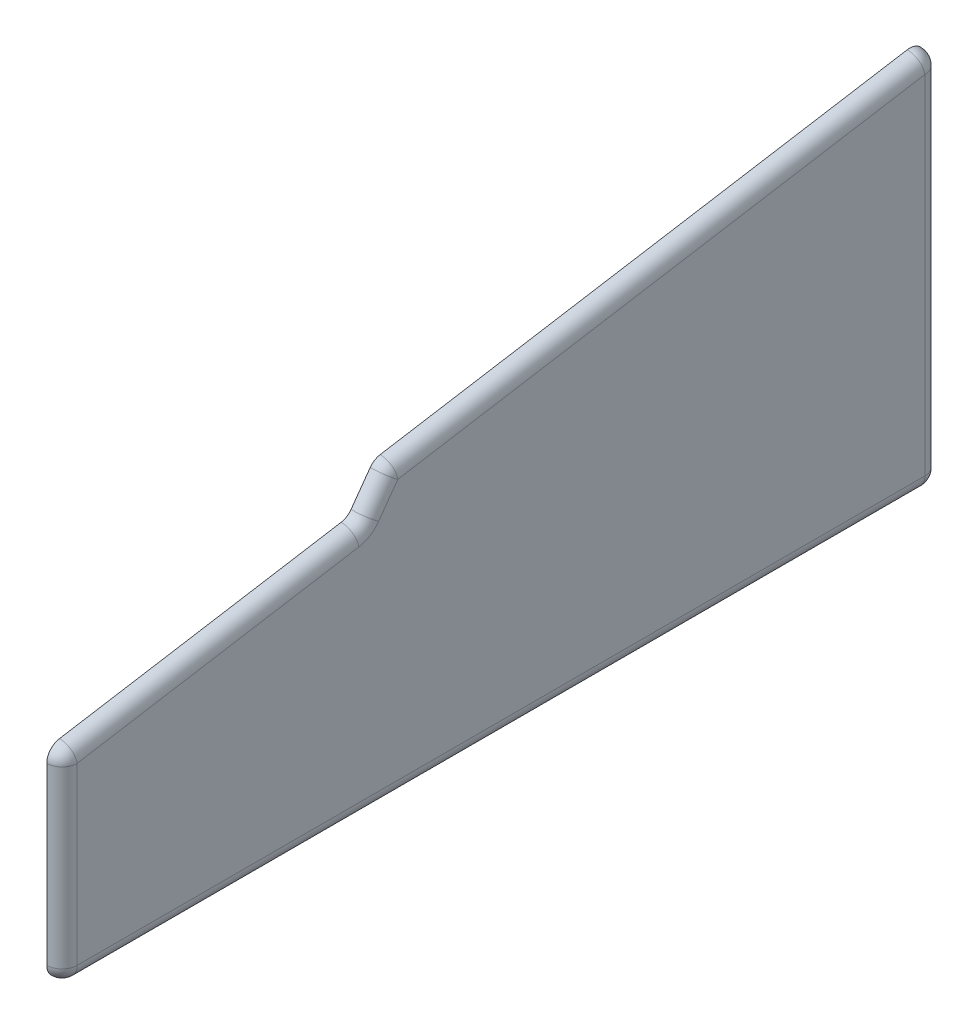
ISO-10303-21;
HEADER;
FILE_DESCRIPTION(('STEP AP214'),'2;1');
FILE_NAME('part.step','',(''),(''),'','','');
FILE_SCHEMA(('AUTOMOTIVE_DESIGN { 1 0 10303 214 1 1 1 1 }'));
ENDSEC;
DATA;
#1=APPLICATION_CONTEXT('core data for automotive mechanical design processes');
#2=APPLICATION_PROTOCOL_DEFINITION('international standard','automotive_design',2000,#1);
#3=PRODUCT_CONTEXT('',#1,'mechanical');
#4=PRODUCT('Part','Part','',(#3));
#5=PRODUCT_RELATED_PRODUCT_CATEGORY('part','',(#4));
#6=PRODUCT_DEFINITION_FORMATION('','',#4);
#7=PRODUCT_DEFINITION_CONTEXT('part definition',#1,'design');
#8=PRODUCT_DEFINITION('design','',#6,#7);
#9=PRODUCT_DEFINITION_SHAPE('','',#8);
#10=(LENGTH_UNIT() NAMED_UNIT(*) SI_UNIT(.MILLI.,.METRE.));
#11=(NAMED_UNIT(*) PLANE_ANGLE_UNIT() SI_UNIT($,.RADIAN.));
#12=(NAMED_UNIT(*) SI_UNIT($,.STERADIAN.) SOLID_ANGLE_UNIT());
#13=UNCERTAINTY_MEASURE_WITH_UNIT(LENGTH_MEASURE(1.E-05),#10,'distance_accuracy_value','');
#14=(GEOMETRIC_REPRESENTATION_CONTEXT(3) GLOBAL_UNCERTAINTY_ASSIGNED_CONTEXT((#13)) GLOBAL_UNIT_ASSIGNED_CONTEXT((#10,
#11,#12)) REPRESENTATION_CONTEXT('',''));
#15=CARTESIAN_POINT('',(0.,0.,0.));
#16=DIRECTION('',(0.,0.,1.));
#17=DIRECTION('',(1.,0.,0.));
#18=AXIS2_PLACEMENT_3D('',#15,#16,#17);
#19=CARTESIAN_POINT('',(-327.974562358316,0.,137.10500183886));
#20=DIRECTION('',(0.,0.,-1.));
#21=DIRECTION('',(1.,0.,0.));
#22=AXIS2_PLACEMENT_3D('',#19,#20,#21);
#23=PLANE('',#22);
#24=DIRECTION('',(0.,-1.,0.));
#25=VECTOR('',#24,1.);
#26=CARTESIAN_POINT('',(-325.974562358316,0.,137.10500183886));
#27=LINE('',#26,#25);
#28=CARTESIAN_POINT('',(-325.974562358316,14.690261728625,137.10500183886));
#29=VERTEX_POINT('',#28);
#30=CARTESIAN_POINT('',(-325.974562358316,-0.0195091277780118,137.10500183886));
#31=VERTEX_POINT('',#30);
#32=EDGE_CURVE('E239',#29,#31,#27,.T.);
#33=ORIENTED_EDGE('',*,*,#32,.F.);
#34=DIRECTION('',(1.,0.,0.));
#35=VECTOR('',#34,1.);
#36=CARTESIAN_POINT('',(-327.974562358316,14.690261728625,137.10500183886));
#37=LINE('',#36,#35);
#38=CARTESIAN_POINT('',(-327.974562358316,14.690261728625,137.10500183886));
#39=VERTEX_POINT('',#38);
#40=EDGE_CURVE('E271',#39,#29,#37,.T.);
#41=ORIENTED_EDGE('',*,*,#40,.F.);
#42=DIRECTION('',(0.,-1.,0.));
#43=VECTOR('',#42,1.);
#44=CARTESIAN_POINT('',(-327.974562358316,0.,137.10500183886));
#45=LINE('',#44,#43);
#46=CARTESIAN_POINT('',(-327.974562358316,-0.0195091277780118,137.10500183886));
#47=VERTEX_POINT('',#46);
#48=EDGE_CURVE('E240',#39,#47,#45,.T.);
#49=ORIENTED_EDGE('',*,*,#48,.T.);
#50=DIRECTION('',(1.,0.,0.));
#51=VECTOR('',#50,1.);
#52=CARTESIAN_POINT('',(-327.974562358316,-0.0195091277780118,137.10500183886));
#53=LINE('',#52,#51);
#54=EDGE_CURVE('E300',#47,#31,#53,.T.);
#55=ORIENTED_EDGE('',*,*,#54,.T.);
#56=EDGE_LOOP('',(#33,#41,#49,#55));
#57=FACE_BOUND('',#56,.T.);
#58=ADVANCED_FACE('F35',(#57),#23,.F.);
#59=CARTESIAN_POINT('',(-327.974562358316,-0.0195091277779954,0.));
#60=DIRECTION('',(0.,-1.,0.));
#61=DIRECTION('',(0.,0.,-1.));
#62=AXIS2_PLACEMENT_3D('',#59,#60,#61);
#63=PLANE('',#62);
#64=DIRECTION('',(0.,0.,1.));
#65=VECTOR('',#64,1.);
#66=CARTESIAN_POINT('',(-325.974562358316,-0.0195091277779954,0.));
#67=LINE('',#66,#65);
#68=CARTESIAN_POINT('',(-325.974562358316,-0.0195091277780113,129.50500183886));
#69=VERTEX_POINT('',#68);
#70=EDGE_CURVE('E244',#69,#31,#67,.T.);
#71=ORIENTED_EDGE('',*,*,#70,.T.);
#72=ORIENTED_EDGE('',*,*,#54,.F.);
#73=DIRECTION('',(0.,0.,1.));
#74=VECTOR('',#73,1.);
#75=CARTESIAN_POINT('',(-327.974562358316,-0.0195091277779954,0.));
#76=LINE('',#75,#74);
#77=CARTESIAN_POINT('',(-327.974562358316,-0.0195091277780113,129.50500183886));
#78=VERTEX_POINT('',#77);
#79=EDGE_CURVE('E269',#78,#47,#76,.T.);
#80=ORIENTED_EDGE('',*,*,#79,.F.);
#81=DIRECTION('',(1.,0.,0.));
#82=VECTOR('',#81,1.);
#83=CARTESIAN_POINT('',(-327.974562358316,-0.0195091277780113,129.50500183886));
#84=LINE('',#83,#82);
#85=EDGE_CURVE('E303',#78,#69,#84,.T.);
#86=ORIENTED_EDGE('',*,*,#85,.T.);
#87=EDGE_LOOP('',(#71,#72,#80,#86));
#88=FACE_BOUND('',#87,.T.);
#89=ADVANCED_FACE('F399',(#88),#63,.T.);
#90=CARTESIAN_POINT('',(-327.974562358316,0.,129.50500183886));
#91=DIRECTION('',(0.,0.,1.));
#92=DIRECTION('',(-1.,0.,0.));
#93=AXIS2_PLACEMENT_3D('',#90,#91,#92);
#94=PLANE('',#93);
#95=DIRECTION('',(0.,1.,0.));
#96=VECTOR('',#95,1.);
#97=CARTESIAN_POINT('',(-325.974562358316,0.,129.50500183886));
#98=LINE('',#97,#96);
#99=CARTESIAN_POINT('',(-325.974562358316,-17.019509127778,129.50500183886));
#100=VERTEX_POINT('',#99);
#101=EDGE_CURVE('E297',#100,#69,#98,.T.);
#102=ORIENTED_EDGE('',*,*,#101,.T.);
#103=ORIENTED_EDGE('',*,*,#85,.F.);
#104=DIRECTION('',(0.,1.,0.));
#105=VECTOR('',#104,1.);
#106=CARTESIAN_POINT('',(-327.974562358316,0.,129.50500183886));
#107=LINE('',#106,#105);
#108=CARTESIAN_POINT('',(-327.974562358316,-17.019509127778,129.50500183886));
#109=VERTEX_POINT('',#108);
#110=EDGE_CURVE('E267',#109,#78,#107,.T.);
#111=ORIENTED_EDGE('',*,*,#110,.F.);
#112=DIRECTION('',(1.,0.,0.));
#113=VECTOR('',#112,1.);
#114=CARTESIAN_POINT('',(-327.974562358316,-17.019509127778,129.50500183886));
#115=LINE('',#114,#113);
#116=EDGE_CURVE('E306',#109,#100,#115,.T.);
#117=ORIENTED_EDGE('',*,*,#116,.T.);
#118=EDGE_LOOP('',(#102,#103,#111,#117));
#119=FACE_BOUND('',#118,.T.);
#120=ADVANCED_FACE('F405',(#119),#94,.T.);
#121=CARTESIAN_POINT('',(-327.974562358316,-17.019509127778,0.));
#122=DIRECTION('',(0.,-1.,0.));
#123=DIRECTION('',(0.,0.,-1.));
#124=AXIS2_PLACEMENT_3D('',#121,#122,#123);
#125=PLANE('',#124);
#126=DIRECTION('',(0.,0.,1.));
#127=VECTOR('',#126,1.);
#128=CARTESIAN_POINT('',(-325.974562358316,-17.019509127778,0.));
#129=LINE('',#128,#127);
#130=CARTESIAN_POINT('',(-325.974562358316,-17.019509127778,-21.8489705992885));
#131=VERTEX_POINT('',#130);
#132=EDGE_CURVE('E295',#131,#100,#129,.T.);
#133=ORIENTED_EDGE('',*,*,#132,.T.);
#134=ORIENTED_EDGE('',*,*,#116,.F.);
#135=DIRECTION('',(0.,0.,1.));
#136=VECTOR('',#135,1.);
#137=CARTESIAN_POINT('',(-327.974562358316,-17.019509127778,0.));
#138=LINE('',#137,#136);
#139=CARTESIAN_POINT('',(-327.974562358316,-17.019509127778,-21.8489705992885));
#140=VERTEX_POINT('',#139);
#141=EDGE_CURVE('E265',#140,#109,#138,.T.);
#142=ORIENTED_EDGE('',*,*,#141,.F.);
#143=DIRECTION('',(1.,0.,0.));
#144=VECTOR('',#143,1.);
#145=CARTESIAN_POINT('',(-327.974562358316,-17.019509127778,-21.8489705992885));
#146=LINE('',#145,#144);
#147=EDGE_CURVE('E309',#140,#131,#146,.T.);
#148=ORIENTED_EDGE('',*,*,#147,.T.);
#149=EDGE_LOOP('',(#133,#134,#142,#148));
#150=FACE_BOUND('',#149,.T.);
#151=ADVANCED_FACE('F602',(#150),#125,.T.);
#152=CARTESIAN_POINT('',(-327.974562358316,0.,-21.8489705992885));
#153=DIRECTION('',(0.,0.,-1.));
#154=DIRECTION('',(0.,1.,0.));
#155=AXIS2_PLACEMENT_3D('',#152,#153,#154);
#156=PLANE('',#155);
#157=DIRECTION('',(0.,-1.,0.));
#158=VECTOR('',#157,1.);
#159=CARTESIAN_POINT('',(-325.974562358316,0.,-21.8489705992885));
#160=LINE('',#159,#158);
#161=CARTESIAN_POINT('',(-325.974562358316,-0.0195091277780118,-21.8489705992885));
#162=VERTEX_POINT('',#161);
#163=EDGE_CURVE('E293',#162,#131,#160,.T.);
#164=ORIENTED_EDGE('',*,*,#163,.T.);
#165=ORIENTED_EDGE('',*,*,#147,.F.);
#166=DIRECTION('',(0.,-1.,0.));
#167=VECTOR('',#166,1.);
#168=CARTESIAN_POINT('',(-327.974562358316,0.,-21.8489705992885));
#169=LINE('',#168,#167);
#170=CARTESIAN_POINT('',(-327.974562358316,-0.0195091277780118,-21.8489705992885));
#171=VERTEX_POINT('',#170);
#172=EDGE_CURVE('E263',#171,#140,#169,.T.);
#173=ORIENTED_EDGE('',*,*,#172,.F.);
#174=DIRECTION('',(1.,0.,0.));
#175=VECTOR('',#174,1.);
#176=CARTESIAN_POINT('',(-327.974562358316,-0.0195091277780118,-21.8489705992885));
#177=LINE('',#176,#175);
#178=EDGE_CURVE('E312',#171,#162,#177,.T.);
#179=ORIENTED_EDGE('',*,*,#178,.T.);
#180=EDGE_LOOP('',(#164,#165,#173,#179));
#181=FACE_BOUND('',#180,.T.);
#182=ADVANCED_FACE('F591',(#181),#156,.T.);
#183=CARTESIAN_POINT('',(-327.974562358316,-0.0195091277780118,0.));
#184=DIRECTION('',(0.,1.,0.));
#185=DIRECTION('',(0.,0.,1.));
#186=AXIS2_PLACEMENT_3D('',#183,#184,#185);
#187=PLANE('',#186);
#188=DIRECTION('',(0.,0.,-1.));
#189=VECTOR('',#188,1.);
#190=CARTESIAN_POINT('',(-325.974562358316,-0.0195091277780118,0.));
#191=LINE('',#190,#189);
#192=CARTESIAN_POINT('',(-325.974562358316,-0.0195091277780118,-29.4489705992885));
#193=VERTEX_POINT('',#192);
#194=EDGE_CURVE('E290',#162,#193,#191,.T.);
#195=ORIENTED_EDGE('',*,*,#194,.F.);
#196=ORIENTED_EDGE('',*,*,#178,.F.);
#197=DIRECTION('',(0.,0.,-1.));
#198=VECTOR('',#197,1.);
#199=CARTESIAN_POINT('',(-327.974562358316,-0.0195091277780118,0.));
#200=LINE('',#199,#198);
#201=CARTESIAN_POINT('',(-327.974562358316,-0.0195091277780118,-29.4489705992885));
#202=VERTEX_POINT('',#201);
#203=EDGE_CURVE('E260',#171,#202,#200,.T.);
#204=ORIENTED_EDGE('',*,*,#203,.T.);
#205=DIRECTION('',(1.,0.,0.));
#206=VECTOR('',#205,1.);
#207=CARTESIAN_POINT('',(-327.974562358316,-0.0195091277780118,-29.4489705992885));
#208=LINE('',#207,#206);
#209=EDGE_CURVE('E315',#202,#193,#208,.T.);
#210=ORIENTED_EDGE('',*,*,#209,.T.);
#211=EDGE_LOOP('',(#195,#196,#204,#210));
#212=FACE_BOUND('',#211,.T.);
#213=ADVANCED_FACE('F581',(#212),#187,.F.);
#214=CARTESIAN_POINT('',(-327.974562358316,0.,-29.4489705992885));
#215=DIRECTION('',(0.,0.,1.));
#216=DIRECTION('',(-1.,0.,0.));
#217=AXIS2_PLACEMENT_3D('',#214,#215,#216);
#218=PLANE('',#217);
#219=DIRECTION('',(0.,1.,0.));
#220=VECTOR('',#219,1.);
#221=CARTESIAN_POINT('',(-325.974562358316,0.,-29.4489705992885));
#222=LINE('',#221,#220);
#223=CARTESIAN_POINT('',(-325.974562358316,47.708117707001,-29.4489705992885));
#224=VERTEX_POINT('',#223);
#225=EDGE_CURVE('E287',#193,#224,#222,.T.);
#226=ORIENTED_EDGE('',*,*,#225,.F.);
#227=ORIENTED_EDGE('',*,*,#209,.F.);
#228=DIRECTION('',(0.,1.,0.));
#229=VECTOR('',#228,1.);
#230=CARTESIAN_POINT('',(-327.974562358316,0.,-29.4489705992885));
#231=LINE('',#230,#229);
#232=CARTESIAN_POINT('',(-327.974562358316,47.708117707001,-29.4489705992885));
#233=VERTEX_POINT('',#232);
#234=EDGE_CURVE('E257',#202,#233,#231,.T.);
#235=ORIENTED_EDGE('',*,*,#234,.T.);
#236=DIRECTION('',(1.,0.,0.));
#237=VECTOR('',#236,1.);
#238=CARTESIAN_POINT('',(-327.974562358316,47.708117707001,-29.4489705992885));
#239=LINE('',#238,#237);
#240=EDGE_CURVE('E318',#233,#224,#239,.T.);
#241=ORIENTED_EDGE('',*,*,#240,.T.);
#242=EDGE_LOOP('',(#226,#227,#235,#241));
#243=FACE_BOUND('',#242,.T.);
#244=ADVANCED_FACE('F571',(#243),#218,.F.);
#245=CARTESIAN_POINT('',(-327.974562358316,47.708117707001,-26.6489705992885));
#246=DIRECTION('',(1.,0.,0.));
#247=DIRECTION('',(0.,0.,1.));
#248=AXIS2_PLACEMENT_3D('',#245,#246,#247);
#249=CYLINDRICAL_SURFACE('',#248,2.8);
#250=CARTESIAN_POINT('',(-325.974562358316,47.708117707001,-26.6489705992885));
#251=DIRECTION('',(-1.,0.,0.));
#252=DIRECTION('',(0.,0.,1.));
#253=AXIS2_PLACEMENT_3D('',#250,#251,#252);
#254=CIRCLE('',#253,2.8);
#255=CARTESIAN_POINT('',(-325.974562358316,50.4706843968319,-26.1926535119064));
#256=VERTEX_POINT('',#255);
#257=EDGE_CURVE('E285',#256,#224,#254,.T.);
#258=ORIENTED_EDGE('',*,*,#257,.T.);
#259=ORIENTED_EDGE('',*,*,#240,.F.);
#260=CARTESIAN_POINT('',(-327.974562358316,47.708117707001,-26.6489705992885));
#261=DIRECTION('',(-1.,0.,0.));
#262=DIRECTION('',(0.,0.,1.));
#263=AXIS2_PLACEMENT_3D('',#260,#261,#262);
#264=CIRCLE('',#263,2.8);
#265=CARTESIAN_POINT('',(-327.974562358316,50.4706843968319,-26.1926535119064));
#266=VERTEX_POINT('',#265);
#267=EDGE_CURVE('E255',#266,#233,#264,.T.);
#268=ORIENTED_EDGE('',*,*,#267,.F.);
#269=DIRECTION('',(1.,0.,0.));
#270=VECTOR('',#269,1.);
#271=CARTESIAN_POINT('',(-327.974562358316,50.4706843968319,-26.1926535119064));
#272=LINE('',#271,#270);
#273=EDGE_CURVE('E321',#266,#256,#272,.T.);
#274=ORIENTED_EDGE('',*,*,#273,.T.);
#275=EDGE_LOOP('',(#258,#259,#268,#274));
#276=FACE_BOUND('',#275,.T.);
#277=ADVANCED_FACE('F561',(#276),#249,.T.);
#278=CARTESIAN_POINT('',(-327.974562358316,44.9186564788282,7.41960386657439));
#279=DIRECTION('',(0.,-0.98663096065388,-0.162970388350771));
#280=DIRECTION('',(0.,0.162970388350771,-0.98663096065388));
#281=AXIS2_PLACEMENT_3D('',#278,#279,#280);
#282=PLANE('',#281);
#283=DIRECTION('',(0.,-0.162970388350771,0.98663096065388));
#284=VECTOR('',#283,1.);
#285=CARTESIAN_POINT('',(-325.974562358316,44.9186564788282,7.41960386657439));
#286=LINE('',#285,#284);
#287=CARTESIAN_POINT('',(-325.974562358316,33.912543623929,74.0511668700437));
#288=VERTEX_POINT('',#287);
#289=EDGE_CURVE('E282',#256,#288,#286,.T.);
#290=ORIENTED_EDGE('',*,*,#289,.F.);
#291=ORIENTED_EDGE('',*,*,#273,.F.);
#292=DIRECTION('',(0.,-0.162970388350771,0.98663096065388));
#293=VECTOR('',#292,1.);
#294=CARTESIAN_POINT('',(-327.974562358316,44.9186564788282,7.41960386657439));
#295=LINE('',#294,#293);
#296=CARTESIAN_POINT('',(-327.974562358316,33.912543623929,74.0511668700437));
#297=VERTEX_POINT('',#296);
#298=EDGE_CURVE('E252',#266,#297,#295,.T.);
#299=ORIENTED_EDGE('',*,*,#298,.T.);
#300=DIRECTION('',(1.,0.,0.));
#301=VECTOR('',#300,1.);
#302=CARTESIAN_POINT('',(-327.974562358316,33.912543623929,74.0511668700437));
#303=LINE('',#302,#301);
#304=EDGE_CURVE('E324',#297,#288,#303,.T.);
#305=ORIENTED_EDGE('',*,*,#304,.T.);
#306=EDGE_LOOP('',(#290,#291,#299,#305));
#307=FACE_BOUND('',#306,.T.);
#308=ADVANCED_FACE('F551',(#307),#282,.F.);
#309=CARTESIAN_POINT('',(-327.974562358316,46.5622513804118,64.9879681018858));
#310=DIRECTION('',(0.,-0.582415976071519,-0.812890909542394));
#311=DIRECTION('',(0.,0.812890909542394,-0.582415976071519));
#312=AXIS2_PLACEMENT_3D('',#309,#310,#311);
#313=PLANE('',#312);
#314=DIRECTION('',(0.,-0.812890909542394,0.582415976071519));
#315=VECTOR('',#314,1.);
#316=CARTESIAN_POINT('',(-325.974562358316,46.5622513804118,64.9879681018858));
#317=LINE('',#316,#315);
#318=CARTESIAN_POINT('',(-325.974562358316,26.6175096435601,79.2778759970325));
#319=VERTEX_POINT('',#318);
#320=EDGE_CURVE('E279',#288,#319,#317,.T.);
#321=ORIENTED_EDGE('',*,*,#320,.F.);
#322=ORIENTED_EDGE('',*,*,#304,.F.);
#323=DIRECTION('',(0.,-0.812890909542394,0.582415976071519));
#324=VECTOR('',#323,1.);
#325=CARTESIAN_POINT('',(-327.974562358316,46.5622513804118,64.9879681018858));
#326=LINE('',#325,#324);
#327=CARTESIAN_POINT('',(-327.974562358316,26.6175096435601,79.2778759970325));
#328=VERTEX_POINT('',#327);
#329=EDGE_CURVE('E249',#297,#328,#326,.T.);
#330=ORIENTED_EDGE('',*,*,#329,.T.);
#331=DIRECTION('',(1.,0.,0.));
#332=VECTOR('',#331,1.);
#333=CARTESIAN_POINT('',(-327.974562358316,26.6175096435601,79.2778759970325));
#334=LINE('',#333,#332);
#335=EDGE_CURVE('E327',#328,#319,#334,.T.);
#336=ORIENTED_EDGE('',*,*,#335,.T.);
#337=EDGE_LOOP('',(#321,#322,#330,#336));
#338=FACE_BOUND('',#337,.T.);
#339=ADVANCED_FACE('F542',(#338),#313,.F.);
#340=CARTESIAN_POINT('',(-327.974562358316,38.6577849251494,6.38544143988436));
#341=DIRECTION('',(0.,-0.98663096065388,-0.162970388350771));
#342=DIRECTION('',(0.,0.162970388350771,-0.98663096065388));
#343=AXIS2_PLACEMENT_3D('',#340,#341,#342);
#344=PLANE('',#343);
#345=DIRECTION('',(0.,-0.162970388350772,0.98663096065388));
#346=VECTOR('',#345,1.);
#347=CARTESIAN_POINT('',(-325.974562358316,38.6577849251494,6.38544143988436));
#348=LINE('',#347,#346);
#349=CARTESIAN_POINT('',(-325.974562358316,17.4528284184559,134.761318926242));
#350=VERTEX_POINT('',#349);
#351=EDGE_CURVE('E276',#319,#350,#348,.T.);
#352=ORIENTED_EDGE('',*,*,#351,.F.);
#353=ORIENTED_EDGE('',*,*,#335,.F.);
#354=DIRECTION('',(0.,-0.162970388350772,0.98663096065388));
#355=VECTOR('',#354,1.);
#356=CARTESIAN_POINT('',(-327.974562358316,38.6577849251494,6.38544143988436));
#357=LINE('',#356,#355);
#358=CARTESIAN_POINT('',(-327.974562358316,17.4528284184559,134.761318926242));
#359=VERTEX_POINT('',#358);
#360=EDGE_CURVE('E246',#328,#359,#357,.T.);
#361=ORIENTED_EDGE('',*,*,#360,.T.);
#362=DIRECTION('',(1.,0.,0.));
#363=VECTOR('',#362,1.);
#364=CARTESIAN_POINT('',(-327.974562358316,17.4528284184559,134.761318926242));
#365=LINE('',#364,#363);
#366=EDGE_CURVE('E330',#359,#350,#365,.T.);
#367=ORIENTED_EDGE('',*,*,#366,.T.);
#368=EDGE_LOOP('',(#352,#353,#361,#367));
#369=FACE_BOUND('',#368,.T.);
#370=ADVANCED_FACE('F533',(#369),#344,.F.);
#371=CARTESIAN_POINT('',(-327.974562358316,14.690261728625,134.30500183886));
#372=DIRECTION('',(1.,0.,0.));
#373=DIRECTION('',(0.,0.,1.));
#374=AXIS2_PLACEMENT_3D('',#371,#372,#373);
#375=CYLINDRICAL_SURFACE('',#374,2.8);
#376=CARTESIAN_POINT('',(-325.974562358316,14.690261728625,134.30500183886));
#377=DIRECTION('',(-1.,0.,0.));
#378=DIRECTION('',(0.,0.,1.));
#379=AXIS2_PLACEMENT_3D('',#376,#377,#378);
#380=CIRCLE('',#379,2.8);
#381=EDGE_CURVE('E274',#29,#350,#380,.T.);
#382=ORIENTED_EDGE('',*,*,#381,.T.);
#383=ORIENTED_EDGE('',*,*,#366,.F.);
#384=CARTESIAN_POINT('',(-327.974562358316,14.690261728625,134.30500183886));
#385=DIRECTION('',(-1.,0.,0.));
#386=DIRECTION('',(0.,0.,1.));
#387=AXIS2_PLACEMENT_3D('',#384,#385,#386);
#388=CIRCLE('',#387,2.8);
#389=EDGE_CURVE('E243',#39,#359,#388,.T.);
#390=ORIENTED_EDGE('',*,*,#389,.F.);
#391=ORIENTED_EDGE('',*,*,#40,.T.);
#392=EDGE_LOOP('',(#382,#383,#390,#391));
#393=FACE_BOUND('',#392,.T.);
#394=ADVANCED_FACE('F411',(#393),#375,.T.);
#395=CARTESIAN_POINT('',(-327.974562358316,0.,0.));
#396=DIRECTION('',(1.,0.,0.));
#397=DIRECTION('',(0.,0.,1.));
#398=AXIS2_PLACEMENT_3D('',#395,#396,#397);
#399=PLANE('',#398);
#400=ORIENTED_EDGE('',*,*,#48,.F.);
#401=ORIENTED_EDGE('',*,*,#389,.T.);
#402=ORIENTED_EDGE('',*,*,#360,.F.);
#403=ORIENTED_EDGE('',*,*,#329,.F.);
#404=ORIENTED_EDGE('',*,*,#298,.F.);
#405=ORIENTED_EDGE('',*,*,#267,.T.);
#406=ORIENTED_EDGE('',*,*,#234,.F.);
#407=ORIENTED_EDGE('',*,*,#203,.F.);
#408=ORIENTED_EDGE('',*,*,#172,.T.);
#409=ORIENTED_EDGE('',*,*,#141,.T.);
#410=ORIENTED_EDGE('',*,*,#110,.T.);
#411=ORIENTED_EDGE('',*,*,#79,.T.);
#412=EDGE_LOOP('',(#400,#401,#402,#403,#404,#405,#406,#407,#408,#409,#410,#411));
#413=FACE_BOUND('',#412,.T.);
#414=ADVANCED_FACE('F514',(#413),#399,.F.);
#415=CARTESIAN_POINT('',(-322.974562358316,0.,0.));
#416=DIRECTION('',(1.,0.,0.));
#417=DIRECTION('',(0.,0.,1.));
#418=AXIS2_PLACEMENT_3D('',#415,#416,#417);
#419=PLANE('',#418);
#420=DIRECTION('',(0.,-1.,0.));
#421=VECTOR('',#420,1.);
#422=CARTESIAN_POINT('',(-322.974562358316,-17.219509127778,-29.6489705992885));
#423=LINE('',#422,#421);
#424=CARTESIAN_POINT('',(-322.974562358316,51.2443042896114,-29.6489705992885));
#425=VERTEX_POINT('',#424);
#426=CARTESIAN_POINT('',(-322.974562358316,-17.219509127778,-29.6489705992885));
#427=VERTEX_POINT('',#426);
#428=EDGE_CURVE('E44',#425,#427,#423,.T.);
#429=ORIENTED_EDGE('',*,*,#428,.F.);
#430=DIRECTION('',(0.,0.162970388350771,-0.98663096065388));
#431=VECTOR('',#430,1.);
#432=CARTESIAN_POINT('',(-322.974562358316,51.2443042896114,-29.6489705992885));
#433=LINE('',#432,#431);
#434=CARTESIAN_POINT('',(-322.974562358316,34.0963689070357,74.1654961327059));
#435=VERTEX_POINT('',#434);
#436=EDGE_CURVE('E345',#435,#425,#433,.T.);
#437=ORIENTED_EDGE('',*,*,#436,.F.);
#438=DIRECTION('',(0.,0.812890909542392,-0.582415976071521));
#439=VECTOR('',#438,1.);
#440=CARTESIAN_POINT('',(-322.974562358316,34.0963689070357,74.1654961327059));
#441=LINE('',#440,#439);
#442=CARTESIAN_POINT('',(-322.974562358316,28.8215975634404,77.9447376823052));
#443=VERTEX_POINT('',#442);
#444=EDGE_CURVE('E342',#443,#435,#441,.T.);
#445=ORIENTED_EDGE('',*,*,#444,.F.);
#446=CARTESIAN_POINT('',(-322.974562358316,32.3160934198696,82.8220831395595));
#447=DIRECTION('',(-1.,0.,0.));
#448=DIRECTION('',(0.,0.,1.));
#449=AXIS2_PLACEMENT_3D('',#446,#447,#448);
#450=CIRCLE('',#449,6.);
#451=CARTESIAN_POINT('',(-322.974562358316,26.3963076559463,81.8442608094549));
#452=VERTEX_POINT('',#451);
#453=EDGE_CURVE('E339',#452,#443,#450,.F.);
#454=ORIENTED_EDGE('',*,*,#453,.F.);
#455=DIRECTION('',(0.,0.162970388350772,-0.98663096065388));
#456=VECTOR('',#455,1.);
#457=CARTESIAN_POINT('',(-322.974562358316,26.3963076559463,81.8442608094549));
#458=LINE('',#457,#456);
#459=CARTESIAN_POINT('',(-322.974562358316,17.2353763004234,137.30500183886));
#460=VERTEX_POINT('',#459);
#461=EDGE_CURVE('E336',#460,#452,#458,.T.);
#462=ORIENTED_EDGE('',*,*,#461,.F.);
#463=DIRECTION('',(0.,1.,0.));
#464=VECTOR('',#463,1.);
#465=CARTESIAN_POINT('',(-322.974562358316,17.2353763004234,137.30500183886));
#466=LINE('',#465,#464);
#467=CARTESIAN_POINT('',(-322.974562358316,-17.219509127778,137.30500183886));
#468=VERTEX_POINT('',#467);
#469=EDGE_CURVE('E191',#468,#460,#466,.T.);
#470=ORIENTED_EDGE('',*,*,#469,.F.);
#471=DIRECTION('',(0.,0.,1.));
#472=VECTOR('',#471,1.);
#473=CARTESIAN_POINT('',(-322.974562358316,-17.219509127778,137.30500183886));
#474=LINE('',#473,#472);
#475=EDGE_CURVE('E11',#427,#468,#474,.T.);
#476=ORIENTED_EDGE('',*,*,#475,.F.);
#477=EDGE_LOOP('',(#429,#437,#445,#454,#462,#470,#476));
#478=FACE_BOUND('',#477,.T.);
#479=ADVANCED_FACE('F378',(#478),#419,.T.);
#480=CARTESIAN_POINT('',(-325.974562358316,0.,0.));
#481=DIRECTION('',(1.,0.,0.));
#482=DIRECTION('',(0.,0.,1.));
#483=AXIS2_PLACEMENT_3D('',#480,#481,#482);
#484=PLANE('',#483);
#485=ORIENTED_EDGE('',*,*,#32,.T.);
#486=ORIENTED_EDGE('',*,*,#70,.F.);
#487=ORIENTED_EDGE('',*,*,#101,.F.);
#488=ORIENTED_EDGE('',*,*,#132,.F.);
#489=ORIENTED_EDGE('',*,*,#163,.F.);
#490=ORIENTED_EDGE('',*,*,#194,.T.);
#491=ORIENTED_EDGE('',*,*,#225,.T.);
#492=ORIENTED_EDGE('',*,*,#257,.F.);
#493=ORIENTED_EDGE('',*,*,#289,.T.);
#494=ORIENTED_EDGE('',*,*,#320,.T.);
#495=ORIENTED_EDGE('',*,*,#351,.T.);
#496=ORIENTED_EDGE('',*,*,#381,.F.);
#497=EDGE_LOOP('',(#485,#486,#487,#488,#489,#490,#491,#492,#493,#494,#495,#496));
#498=FACE_BOUND('',#497,.T.);
#499=DIRECTION('',(0.,1.,0.));
#500=VECTOR('',#499,1.);
#501=CARTESIAN_POINT('',(-325.974562358316,0.,140.30500183886));
#502=LINE('',#501,#500);
#503=CARTESIAN_POINT('',(-325.974562358316,-17.219509127778,140.30500183886));
#504=VERTEX_POINT('',#503);
#505=CARTESIAN_POINT('',(-325.974562358316,17.2353763004234,140.30500183886));
#506=VERTEX_POINT('',#505);
#507=EDGE_CURVE('E189',#504,#506,#502,.T.);
#508=ORIENTED_EDGE('',*,*,#507,.T.);
#509=CARTESIAN_POINT('',(-325.974562358316,17.2353763004234,137.30500183886));
#510=DIRECTION('',(-1.,0.,0.));
#511=DIRECTION('',(0.,0.,1.));
#512=AXIS2_PLACEMENT_3D('',#509,#510,#511);
#513=CIRCLE('',#512,3.);
#514=CARTESIAN_POINT('',(-325.974562358316,20.1952691823851,137.793913003912));
#515=VERTEX_POINT('',#514);
#516=EDGE_CURVE('E198',#506,#515,#513,.T.);
#517=ORIENTED_EDGE('',*,*,#516,.T.);
#518=DIRECTION('',(0.,0.162970388350772,-0.98663096065388));
#519=VECTOR('',#518,1.);
#520=CARTESIAN_POINT('',(-325.974562358316,41.8150039992419,6.90694668260686));
#521=LINE('',#520,#519);
#522=CARTESIAN_POINT('',(-325.974562358316,29.3562005379079,82.3331719745072));
#523=VERTEX_POINT('',#522);
#524=EDGE_CURVE('E204',#515,#523,#521,.T.);
#525=ORIENTED_EDGE('',*,*,#524,.T.);
#526=CARTESIAN_POINT('',(-325.974562358316,32.3160934198696,82.8220831395595));
#527=DIRECTION('',(-1.,0.,0.));
#528=DIRECTION('',(0.,0.,1.));
#529=AXIS2_PLACEMENT_3D('',#526,#527,#528);
#530=CIRCLE('',#529,3.);
#531=CARTESIAN_POINT('',(-325.974562358316,30.568845491655,80.3834104109323));
#532=VERTEX_POINT('',#531);
#533=EDGE_CURVE('E215',#523,#532,#530,.F.);
#534=ORIENTED_EDGE('',*,*,#533,.T.);
#535=DIRECTION('',(0.,0.812890909542392,-0.582415976071521));
#536=VECTOR('',#535,1.);
#537=CARTESIAN_POINT('',(-325.974562358316,48.4259825038408,67.5892190124213));
#538=LINE('',#537,#536);
#539=CARTESIAN_POINT('',(-325.974562358316,35.8436168352503,76.6041688613331));
#540=VERTEX_POINT('',#539);
#541=EDGE_CURVE('E218',#532,#540,#538,.T.);
#542=ORIENTED_EDGE('',*,*,#541,.T.);
#543=CARTESIAN_POINT('',(-325.974562358316,34.0963689070357,74.1654961327059));
#544=DIRECTION('',(-1.,0.,0.));
#545=DIRECTION('',(0.,0.,1.));
#546=AXIS2_PLACEMENT_3D('',#543,#544,#545);
#547=CIRCLE('',#546,3.);
#548=CARTESIAN_POINT('',(-325.974562358316,37.0562617889974,74.6544072977582));
#549=VERTEX_POINT('',#548);
#550=EDGE_CURVE('E221',#540,#549,#547,.T.);
#551=ORIENTED_EDGE('',*,*,#550,.T.);
#552=DIRECTION('',(0.,0.162970388350771,-0.98663096065388));
#553=VECTOR('',#552,1.);
#554=CARTESIAN_POINT('',(-325.974562358316,48.0758755529206,7.94110910929685));
#555=LINE('',#554,#553);
#556=CARTESIAN_POINT('',(-325.974562358316,54.2041971715731,-29.1600594342362));
#557=VERTEX_POINT('',#556);
#558=EDGE_CURVE('E224',#549,#557,#555,.T.);
#559=ORIENTED_EDGE('',*,*,#558,.T.);
#560=CARTESIAN_POINT('',(-325.974562358316,51.2443042896114,-29.6489705992885));
#561=DIRECTION('',(-1.,0.,0.));
#562=DIRECTION('',(0.,0.,1.));
#563=AXIS2_PLACEMENT_3D('',#560,#561,#562);
#564=CIRCLE('',#563,3.);
#565=CARTESIAN_POINT('',(-325.974562358316,51.2443042896114,-32.6489705992885));
#566=VERTEX_POINT('',#565);
#567=EDGE_CURVE('E227',#557,#566,#564,.T.);
#568=ORIENTED_EDGE('',*,*,#567,.T.);
#569=DIRECTION('',(0.,-1.,0.));
#570=VECTOR('',#569,1.);
#571=CARTESIAN_POINT('',(-325.974562358316,0.,-32.6489705992885));
#572=LINE('',#571,#570);
#573=CARTESIAN_POINT('',(-325.974562358316,-17.219509127778,-32.6489705992885));
#574=VERTEX_POINT('',#573);
#575=EDGE_CURVE('E230',#566,#574,#572,.T.);
#576=ORIENTED_EDGE('',*,*,#575,.T.);
#577=CARTESIAN_POINT('',(-325.974562358316,-17.219509127778,-29.6489705992885));
#578=DIRECTION('',(-1.,0.,0.));
#579=DIRECTION('',(0.,0.,1.));
#580=AXIS2_PLACEMENT_3D('',#577,#578,#579);
#581=CIRCLE('',#580,3.);
#582=CARTESIAN_POINT('',(-325.974562358316,-20.219509127778,-29.6489705992885));
#583=VERTEX_POINT('',#582);
#584=EDGE_CURVE('E233',#574,#583,#581,.T.);
#585=ORIENTED_EDGE('',*,*,#584,.T.);
#586=DIRECTION('',(0.,0.,1.));
#587=VECTOR('',#586,1.);
#588=CARTESIAN_POINT('',(-325.974562358316,-20.219509127778,0.));
#589=LINE('',#588,#587);
#590=CARTESIAN_POINT('',(-325.974562358316,-20.219509127778,137.30500183886));
#591=VERTEX_POINT('',#590);
#592=EDGE_CURVE('E236',#583,#591,#589,.T.);
#593=ORIENTED_EDGE('',*,*,#592,.T.);
#594=CARTESIAN_POINT('',(-325.974562358316,-17.219509127778,137.30500183886));
#595=DIRECTION('',(-1.,0.,0.));
#596=DIRECTION('',(0.,0.,1.));
#597=AXIS2_PLACEMENT_3D('',#594,#595,#596);
#598=CIRCLE('',#597,3.);
#599=EDGE_CURVE('E210',#504,#591,#598,.F.);
#600=ORIENTED_EDGE('',*,*,#599,.F.);
#601=EDGE_LOOP('',(#508,#517,#525,#534,#542,#551,#559,#568,#576,#585,#593,#600));
#602=FACE_BOUND('',#601,.T.);
#603=ADVANCED_FACE('F207',(#498,#602),#484,.F.);
#604=CARTESIAN_POINT('',(-325.974562358316,34.0963689070357,74.1654961327059));
#605=DIRECTION('',(1.,0.,0.));
#606=DIRECTION('',(0.,0.,1.));
#607=AXIS2_PLACEMENT_3D('',#604,#605,#606);
#608=SPHERICAL_SURFACE('',#607,3.);
#609=CARTESIAN_POINT('',(-325.974562358316,34.0963689070357,74.1654961327059));
#610=DIRECTION('',(0.,-0.162970388350771,0.98663096065388));
#611=DIRECTION('',(0.,0.98663096065388,0.162970388350771));
#612=AXIS2_PLACEMENT_3D('',#609,#610,#611);
#613=CIRCLE('',#612,3.);
#614=EDGE_CURVE('E212',#435,#549,#613,.T.);
#615=ORIENTED_EDGE('',*,*,#614,.T.);
#616=ORIENTED_EDGE('',*,*,#550,.F.);
#617=CARTESIAN_POINT('',(-325.974562358316,34.0963689070357,74.1654961327059));
#618=DIRECTION('',(0.,0.812890909542392,-0.582415976071521));
#619=DIRECTION('',(0.,-0.582415976071521,-0.812890909542392));
#620=AXIS2_PLACEMENT_3D('',#617,#618,#619);
#621=CIRCLE('',#620,3.);
#622=EDGE_CURVE('E39',#540,#435,#621,.T.);
#623=ORIENTED_EDGE('',*,*,#622,.T.);
#624=EDGE_LOOP('',(#615,#616,#623));
#625=FACE_BOUND('',#624,.T.);
#626=ADVANCED_FACE('F37',(#625),#608,.T.);
#627=CARTESIAN_POINT('',(-325.974562358316,46.6787345756263,65.1505462837941));
#628=DIRECTION('',(0.,-0.812890909542392,0.582415976071521));
#629=DIRECTION('',(0.,-0.582415976071521,-0.812890909542392));
#630=AXIS2_PLACEMENT_3D('',#627,#628,#629);
#631=CYLINDRICAL_SURFACE('',#630,3.);
#632=ORIENTED_EDGE('',*,*,#622,.F.);
#633=ORIENTED_EDGE('',*,*,#541,.F.);
#634=CARTESIAN_POINT('',(-325.974562358316,28.8215975634404,77.9447376823052));
#635=DIRECTION('',(0.,0.812890909542392,-0.582415976071522));
#636=DIRECTION('',(0.,-0.582415976071522,-0.812890909542392));
#637=AXIS2_PLACEMENT_3D('',#634,#635,#636);
#638=CIRCLE('',#637,3.);
#639=EDGE_CURVE('E361',#532,#443,#638,.T.);
#640=ORIENTED_EDGE('',*,*,#639,.T.);
#641=ORIENTED_EDGE('',*,*,#444,.T.);
#642=EDGE_LOOP('',(#632,#633,#640,#641));
#643=FACE_BOUND('',#642,.T.);
#644=ADVANCED_FACE('F372',(#643),#631,.T.);
#645=CARTESIAN_POINT('',(-325.974562358316,45.115982670959,7.45219794424453));
#646=DIRECTION('',(0.,-0.162970388350771,0.98663096065388));
#647=DIRECTION('',(0.,-0.98663096065388,-0.162970388350771));
#648=AXIS2_PLACEMENT_3D('',#645,#646,#647);
#649=CYLINDRICAL_SURFACE('',#648,3.);
#650=ORIENTED_EDGE('',*,*,#614,.F.);
#651=ORIENTED_EDGE('',*,*,#436,.T.);
#652=CARTESIAN_POINT('',(-325.974562358316,51.2443042896114,-29.6489705992885));
#653=DIRECTION('',(0.,-0.162970388350771,0.98663096065388));
#654=DIRECTION('',(0.,0.98663096065388,0.162970388350771));
#655=AXIS2_PLACEMENT_3D('',#652,#653,#654);
#656=CIRCLE('',#655,3.);
#657=EDGE_CURVE('E359',#425,#557,#656,.T.);
#658=ORIENTED_EDGE('',*,*,#657,.T.);
#659=ORIENTED_EDGE('',*,*,#558,.F.);
#660=EDGE_LOOP('',(#650,#651,#658,#659));
#661=FACE_BOUND('',#660,.T.);
#662=ADVANCED_FACE('F367',(#661),#649,.T.);
#663=CARTESIAN_POINT('',(-325.974562358316,32.3160934198696,82.8220831395595));
#664=DIRECTION('',(1.,0.,0.));
#665=DIRECTION('',(0.,0.,1.));
#666=AXIS2_PLACEMENT_3D('',#663,#664,#665);
#667=TOROIDAL_SURFACE('',#666,6.,3.);
#668=ORIENTED_EDGE('',*,*,#639,.F.);
#669=ORIENTED_EDGE('',*,*,#533,.F.);
#670=CARTESIAN_POINT('',(-325.974562358316,26.3963076559463,81.8442608094549));
#671=DIRECTION('',(0.,0.162970388350771,-0.98663096065388));
#672=DIRECTION('',(0.,-0.98663096065388,-0.162970388350771));
#673=AXIS2_PLACEMENT_3D('',#670,#671,#672);
#674=CIRCLE('',#673,3.);
#675=EDGE_CURVE('E357',#523,#452,#674,.T.);
#676=ORIENTED_EDGE('',*,*,#675,.T.);
#677=ORIENTED_EDGE('',*,*,#453,.T.);
#678=EDGE_LOOP('',(#668,#669,#676,#677));
#679=FACE_BOUND('',#678,.T.);
#680=ADVANCED_FACE('F388',(#679),#667,.T.);
#681=CARTESIAN_POINT('',(-325.974562358316,51.2443042896114,-29.6489705992885));
#682=DIRECTION('',(1.,0.,0.));
#683=DIRECTION('',(0.,0.,1.));
#684=AXIS2_PLACEMENT_3D('',#681,#682,#683);
#685=SPHERICAL_SURFACE('',#684,3.);
#686=ORIENTED_EDGE('',*,*,#657,.F.);
#687=CARTESIAN_POINT('',(-325.974562358316,51.2443042896114,-29.6489705992885));
#688=DIRECTION('',(0.,1.,0.));
#689=DIRECTION('',(0.,0.,-1.));
#690=AXIS2_PLACEMENT_3D('',#687,#688,#689);
#691=CIRCLE('',#690,3.);
#692=EDGE_CURVE('E59',#425,#566,#691,.T.);
#693=ORIENTED_EDGE('',*,*,#692,.T.);
#694=ORIENTED_EDGE('',*,*,#567,.F.);
#695=EDGE_LOOP('',(#686,#693,#694));
#696=FACE_BOUND('',#695,.T.);
#697=ADVANCED_FACE('F385',(#696),#685,.T.);
#698=CARTESIAN_POINT('',(-325.974562358316,38.8551111172802,6.41803551755454));
#699=DIRECTION('',(0.,-0.162970388350772,0.98663096065388));
#700=DIRECTION('',(0.,-0.98663096065388,-0.162970388350772));
#701=AXIS2_PLACEMENT_3D('',#698,#699,#700);
#702=CYLINDRICAL_SURFACE('',#701,3.);
#703=ORIENTED_EDGE('',*,*,#675,.F.);
#704=ORIENTED_EDGE('',*,*,#524,.F.);
#705=CARTESIAN_POINT('',(-325.974562358316,17.2353763004235,137.30500183886));
#706=DIRECTION('',(0.,0.162970388350771,-0.98663096065388));
#707=DIRECTION('',(0.,-0.98663096065388,-0.162970388350771));
#708=AXIS2_PLACEMENT_3D('',#705,#706,#707);
#709=CIRCLE('',#708,3.);
#710=EDGE_CURVE('E200',#515,#460,#709,.T.);
#711=ORIENTED_EDGE('',*,*,#710,.T.);
#712=ORIENTED_EDGE('',*,*,#461,.T.);
#713=EDGE_LOOP('',(#703,#704,#711,#712));
#714=FACE_BOUND('',#713,.T.);
#715=ADVANCED_FACE('F387',(#714),#702,.T.);
#716=CARTESIAN_POINT('',(-325.974562358316,0.,-29.6489705992885));
#717=DIRECTION('',(0.,1.,0.));
#718=DIRECTION('',(0.,0.,1.));
#719=AXIS2_PLACEMENT_3D('',#716,#717,#718);
#720=CYLINDRICAL_SURFACE('',#719,3.);
#721=ORIENTED_EDGE('',*,*,#692,.F.);
#722=ORIENTED_EDGE('',*,*,#428,.T.);
#723=CARTESIAN_POINT('',(-325.974562358316,-17.219509127778,-29.6489705992885));
#724=DIRECTION('',(0.,1.,0.));
#725=DIRECTION('',(0.,0.,-1.));
#726=AXIS2_PLACEMENT_3D('',#723,#724,#725);
#727=CIRCLE('',#726,3.);
#728=EDGE_CURVE('E195',#427,#574,#727,.T.);
#729=ORIENTED_EDGE('',*,*,#728,.T.);
#730=ORIENTED_EDGE('',*,*,#575,.F.);
#731=EDGE_LOOP('',(#721,#722,#729,#730));
#732=FACE_BOUND('',#731,.T.);
#733=ADVANCED_FACE('F380',(#732),#720,.T.);
#734=CARTESIAN_POINT('',(-325.974562358316,17.2353763004234,137.30500183886));
#735=DIRECTION('',(1.,0.,0.));
#736=DIRECTION('',(0.,0.,1.));
#737=AXIS2_PLACEMENT_3D('',#734,#735,#736);
#738=SPHERICAL_SURFACE('',#737,3.);
#739=ORIENTED_EDGE('',*,*,#516,.F.);
#740=CARTESIAN_POINT('',(-325.974562358316,17.2353763004234,137.30500183886));
#741=DIRECTION('',(0.,1.,0.));
#742=DIRECTION('',(0.,0.,-1.));
#743=AXIS2_PLACEMENT_3D('',#740,#741,#742);
#744=CIRCLE('',#743,3.);
#745=EDGE_CURVE('E184',#506,#460,#744,.T.);
#746=ORIENTED_EDGE('',*,*,#745,.T.);
#747=ORIENTED_EDGE('',*,*,#710,.F.);
#748=EDGE_LOOP('',(#739,#746,#747));
#749=FACE_BOUND('',#748,.T.);
#750=ADVANCED_FACE('F199',(#749),#738,.T.);
#751=CARTESIAN_POINT('',(-325.974562358316,-17.219509127778,-29.6489705992885));
#752=DIRECTION('',(1.,0.,0.));
#753=DIRECTION('',(0.,0.,1.));
#754=AXIS2_PLACEMENT_3D('',#751,#752,#753);
#755=SPHERICAL_SURFACE('',#754,3.);
#756=ORIENTED_EDGE('',*,*,#728,.F.);
#757=CARTESIAN_POINT('',(-325.974562358316,-17.219509127778,-29.6489705992885));
#758=DIRECTION('',(0.,0.,-1.));
#759=DIRECTION('',(-1.,0.,0.));
#760=AXIS2_PLACEMENT_3D('',#757,#758,#759);
#761=CIRCLE('',#760,3.);
#762=EDGE_CURVE('E51',#427,#583,#761,.T.);
#763=ORIENTED_EDGE('',*,*,#762,.T.);
#764=ORIENTED_EDGE('',*,*,#584,.F.);
#765=EDGE_LOOP('',(#756,#763,#764));
#766=FACE_BOUND('',#765,.T.);
#767=ADVANCED_FACE('F383',(#766),#755,.T.);
#768=CARTESIAN_POINT('',(-325.974562358316,0.,137.30500183886));
#769=DIRECTION('',(0.,-1.,0.));
#770=DIRECTION('',(0.,0.,-1.));
#771=AXIS2_PLACEMENT_3D('',#768,#769,#770);
#772=CYLINDRICAL_SURFACE('',#771,3.);
#773=ORIENTED_EDGE('',*,*,#745,.F.);
#774=ORIENTED_EDGE('',*,*,#507,.F.);
#775=CARTESIAN_POINT('',(-325.974562358316,-17.219509127778,137.30500183886));
#776=DIRECTION('',(0.,1.,0.));
#777=DIRECTION('',(0.,0.,-1.));
#778=AXIS2_PLACEMENT_3D('',#775,#776,#777);
#779=CIRCLE('',#778,3.);
#780=EDGE_CURVE('E351',#504,#468,#779,.T.);
#781=ORIENTED_EDGE('',*,*,#780,.T.);
#782=ORIENTED_EDGE('',*,*,#469,.T.);
#783=EDGE_LOOP('',(#773,#774,#781,#782));
#784=FACE_BOUND('',#783,.T.);
#785=ADVANCED_FACE('F186',(#784),#772,.T.);
#786=CARTESIAN_POINT('',(-325.974562358316,-17.219509127778,0.));
#787=DIRECTION('',(0.,0.,-1.));
#788=DIRECTION('',(1.,0.,0.));
#789=AXIS2_PLACEMENT_3D('',#786,#787,#788);
#790=CYLINDRICAL_SURFACE('',#789,3.);
#791=ORIENTED_EDGE('',*,*,#762,.F.);
#792=ORIENTED_EDGE('',*,*,#475,.T.);
#793=CARTESIAN_POINT('',(-325.974562358316,-17.219509127778,137.30500183886));
#794=DIRECTION('',(0.,0.,-1.));
#795=DIRECTION('',(-1.,0.,0.));
#796=AXIS2_PLACEMENT_3D('',#793,#794,#795);
#797=CIRCLE('',#796,3.);
#798=EDGE_CURVE('E349',#468,#591,#797,.T.);
#799=ORIENTED_EDGE('',*,*,#798,.T.);
#800=ORIENTED_EDGE('',*,*,#592,.F.);
#801=EDGE_LOOP('',(#791,#792,#799,#800));
#802=FACE_BOUND('',#801,.T.);
#803=ADVANCED_FACE('F416',(#802),#790,.T.);
#804=CARTESIAN_POINT('',(-325.974562358316,-17.219509127778,137.30500183886));
#805=DIRECTION('',(1.,0.,0.));
#806=DIRECTION('',(0.,0.,1.));
#807=AXIS2_PLACEMENT_3D('',#804,#805,#806);
#808=SPHERICAL_SURFACE('',#807,3.);
#809=ORIENTED_EDGE('',*,*,#599,.T.);
#810=ORIENTED_EDGE('',*,*,#798,.F.);
#811=ORIENTED_EDGE('',*,*,#780,.F.);
#812=EDGE_LOOP('',(#809,#810,#811));
#813=FACE_BOUND('',#812,.T.);
#814=ADVANCED_FACE('F413',(#813),#808,.T.);
#815=CLOSED_SHELL('',(#58,#89,#120,#151,#182,#213,#244,#277,#308,#339,#370,#394,#414,#479,#603,
#626,#644,#662,#680,#697,#715,#733,#750,#767,#785,#803,#814));
#816=MANIFOLD_SOLID_BREP('B2',#815);
#817=ADVANCED_BREP_SHAPE_REPRESENTATION('',(#18,#816),#14);
#818=SHAPE_DEFINITION_REPRESENTATION(#9,#817);
ENDSEC;
END-ISO-10303-21;
